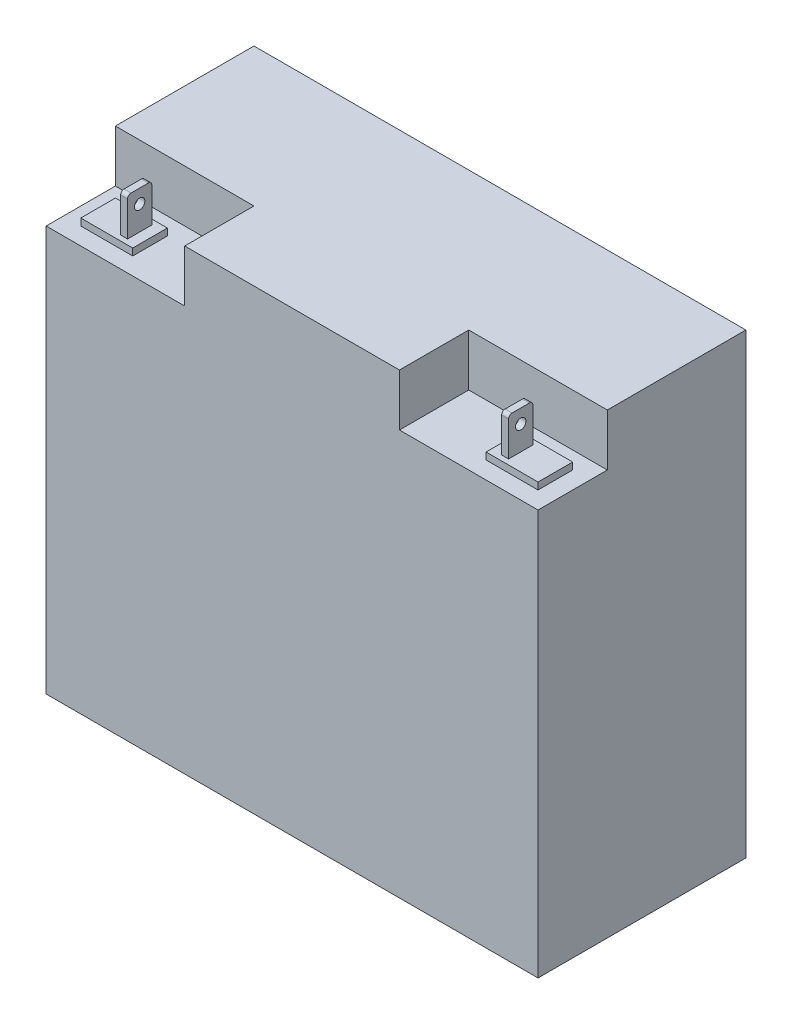
ISO-10303-21;
HEADER;
FILE_DESCRIPTION(('STEP AP214'),'2;1');
FILE_NAME('part.step','',(''),(''),'','','');
FILE_SCHEMA(('AUTOMOTIVE_DESIGN { 1 0 10303 214 1 1 1 1 }'));
ENDSEC;
DATA;
#1=APPLICATION_CONTEXT('core data for automotive mechanical design processes');
#2=APPLICATION_PROTOCOL_DEFINITION('international standard','automotive_design',2000,#1);
#3=PRODUCT_CONTEXT('',#1,'mechanical');
#4=PRODUCT('Part','Part','',(#3));
#5=PRODUCT_RELATED_PRODUCT_CATEGORY('part','',(#4));
#6=PRODUCT_DEFINITION_FORMATION('','',#4);
#7=PRODUCT_DEFINITION_CONTEXT('part definition',#1,'design');
#8=PRODUCT_DEFINITION('design','',#6,#7);
#9=PRODUCT_DEFINITION_SHAPE('','',#8);
#10=(LENGTH_UNIT() NAMED_UNIT(*) SI_UNIT(.MILLI.,.METRE.));
#11=(NAMED_UNIT(*) PLANE_ANGLE_UNIT() SI_UNIT($,.RADIAN.));
#12=(NAMED_UNIT(*) SI_UNIT($,.STERADIAN.) SOLID_ANGLE_UNIT());
#13=UNCERTAINTY_MEASURE_WITH_UNIT(LENGTH_MEASURE(1.E-05),#10,'distance_accuracy_value','');
#14=(GEOMETRIC_REPRESENTATION_CONTEXT(3) GLOBAL_UNCERTAINTY_ASSIGNED_CONTEXT((#13)) GLOBAL_UNIT_ASSIGNED_CONTEXT((#10,
#11,#12)) REPRESENTATION_CONTEXT('',''));
#15=CARTESIAN_POINT('',(0.,0.,0.));
#16=DIRECTION('',(0.,0.,1.));
#17=DIRECTION('',(1.,0.,0.));
#18=AXIS2_PLACEMENT_3D('',#15,#16,#17);
#19=CARTESIAN_POINT('',(161.29,176.885739559386,20.955));
#20=DIRECTION('',(0.,0.,-1.));
#21=DIRECTION('',(-1.,0.,0.));
#22=AXIS2_PLACEMENT_3D('',#19,#20,#21);
#23=PLANE('',#22);
#24=DIRECTION('',(0.,-1.,0.));
#25=VECTOR('',#24,1.);
#26=CARTESIAN_POINT('',(158.75,176.885739559386,20.955));
#27=LINE('',#26,#25);
#28=CARTESIAN_POINT('',(158.75,163.83,20.955));
#29=VERTEX_POINT('',#28);
#30=CARTESIAN_POINT('',(158.75,151.13,20.955));
#31=VERTEX_POINT('',#30);
#32=EDGE_CURVE('E280',#29,#31,#27,.T.);
#33=ORIENTED_EDGE('',*,*,#32,.F.);
#34=DIRECTION('',(-1.,0.,0.));
#35=VECTOR('',#34,1.);
#36=CARTESIAN_POINT('',(180.341,163.83,20.955));
#37=LINE('',#36,#35);
#38=CARTESIAN_POINT('',(161.29,163.83,20.955));
#39=VERTEX_POINT('',#38);
#40=EDGE_CURVE('E242',#39,#29,#37,.T.);
#41=ORIENTED_EDGE('',*,*,#40,.F.);
#42=DIRECTION('',(0.,-1.,0.));
#43=VECTOR('',#42,1.);
#44=CARTESIAN_POINT('',(161.29,176.885739559386,20.955));
#45=LINE('',#44,#43);
#46=CARTESIAN_POINT('',(161.29,151.13,20.955));
#47=VERTEX_POINT('',#46);
#48=EDGE_CURVE('E251',#39,#47,#45,.T.);
#49=ORIENTED_EDGE('',*,*,#48,.T.);
#50=DIRECTION('',(1.,0.,0.));
#51=VECTOR('',#50,1.);
#52=CARTESIAN_POINT('',(161.29,151.13,20.955));
#53=LINE('',#52,#51);
#54=EDGE_CURVE('E266',#31,#47,#53,.T.);
#55=ORIENTED_EDGE('',*,*,#54,.F.);
#56=EDGE_LOOP('',(#33,#41,#49,#55));
#57=FACE_BOUND('',#56,.T.);
#58=ADVANCED_FACE('F39',(#57),#23,.T.);
#59=CARTESIAN_POINT('',(0.,165.1,38.1));
#60=DIRECTION('',(0.,-1.,0.));
#61=DIRECTION('',(0.,0.,-1.));
#62=AXIS2_PLACEMENT_3D('',#59,#60,#61);
#63=PLANE('',#62);
#64=DIRECTION('',(-1.,0.,0.));
#65=VECTOR('',#64,1.);
#66=CARTESIAN_POINT('',(180.341,165.1,22.225));
#67=LINE('',#66,#65);
#68=CARTESIAN_POINT('',(161.29,165.1,22.225));
#69=VERTEX_POINT('',#68);
#70=CARTESIAN_POINT('',(158.75,165.1,22.225));
#71=VERTEX_POINT('',#70);
#72=EDGE_CURVE('E234',#69,#71,#67,.T.);
#73=ORIENTED_EDGE('',*,*,#72,.T.);
#74=DIRECTION('',(0.,0.,1.));
#75=VECTOR('',#74,1.);
#76=CARTESIAN_POINT('',(158.75,165.1,20.955));
#77=LINE('',#76,#75);
#78=CARTESIAN_POINT('',(158.75,165.1,28.575));
#79=VERTEX_POINT('',#78);
#80=EDGE_CURVE('E256',#71,#79,#77,.T.);
#81=ORIENTED_EDGE('',*,*,#80,.T.);
#82=DIRECTION('',(-1.,0.,0.));
#83=VECTOR('',#82,1.);
#84=CARTESIAN_POINT('',(180.341,165.1,28.575));
#85=LINE('',#84,#83);
#86=CARTESIAN_POINT('',(161.29,165.1,28.575));
#87=VERTEX_POINT('',#86);
#88=EDGE_CURVE('E254',#87,#79,#85,.T.);
#89=ORIENTED_EDGE('',*,*,#88,.F.);
#90=DIRECTION('',(0.,0.,-1.));
#91=VECTOR('',#90,1.);
#92=CARTESIAN_POINT('',(161.29,165.1,20.955));
#93=LINE('',#92,#91);
#94=EDGE_CURVE('E249',#87,#69,#93,.T.);
#95=ORIENTED_EDGE('',*,*,#94,.T.);
#96=EDGE_LOOP('',(#73,#81,#89,#95));
#97=FACE_BOUND('',#96,.T.);
#98=ADVANCED_FACE('F253',(#97),#63,.F.);
#99=CARTESIAN_POINT('',(21.59,176.885739559386,20.955));
#100=DIRECTION('',(-1.,0.,0.));
#101=DIRECTION('',(0.,0.,1.));
#102=AXIS2_PLACEMENT_3D('',#99,#100,#101);
#103=PLANE('',#102);
#104=CARTESIAN_POINT('',(21.59,160.02,25.4));
#105=DIRECTION('',(1.,0.,0.));
#106=DIRECTION('',(0.,0.,-1.));
#107=AXIS2_PLACEMENT_3D('',#104,#105,#106);
#108=CIRCLE('',#107,1.90499999999999);
#109=CARTESIAN_POINT('',(21.59,160.02,23.495));
#110=VERTEX_POINT('',#109);
#111=EDGE_CURVE('E332',#110,#110,#108,.T.);
#112=ORIENTED_EDGE('',*,*,#111,.F.);
#113=EDGE_LOOP('',(#112));
#114=FACE_BOUND('',#113,.T.);
#115=CARTESIAN_POINT('',(21.59,163.83,22.225));
#116=DIRECTION('',(1.,0.,0.));
#117=DIRECTION('',(0.,0.,-1.));
#118=AXIS2_PLACEMENT_3D('',#115,#116,#117);
#119=CIRCLE('',#118,1.27);
#120=CARTESIAN_POINT('',(21.59,163.83,20.955));
#121=VERTEX_POINT('',#120);
#122=CARTESIAN_POINT('',(21.59,165.1,22.225));
#123=VERTEX_POINT('',#122);
#124=EDGE_CURVE('E315',#121,#123,#119,.T.);
#125=ORIENTED_EDGE('',*,*,#124,.T.);
#126=DIRECTION('',(0.,0.,1.));
#127=VECTOR('',#126,1.);
#128=CARTESIAN_POINT('',(21.59,165.1,20.955));
#129=LINE('',#128,#127);
#130=CARTESIAN_POINT('',(21.59,165.1,28.575));
#131=VERTEX_POINT('',#130);
#132=EDGE_CURVE('E341',#123,#131,#129,.T.);
#133=ORIENTED_EDGE('',*,*,#132,.T.);
#134=CARTESIAN_POINT('',(21.59,163.83,28.575));
#135=DIRECTION('',(1.,0.,0.));
#136=DIRECTION('',(0.,0.,-1.));
#137=AXIS2_PLACEMENT_3D('',#134,#135,#136);
#138=CIRCLE('',#137,1.27);
#139=CARTESIAN_POINT('',(21.59,163.83,29.845));
#140=VERTEX_POINT('',#139);
#141=EDGE_CURVE('E326',#131,#140,#138,.T.);
#142=ORIENTED_EDGE('',*,*,#141,.T.);
#143=DIRECTION('',(0.,-1.,0.));
#144=VECTOR('',#143,1.);
#145=CARTESIAN_POINT('',(21.59,176.885739559386,29.845));
#146=LINE('',#145,#144);
#147=CARTESIAN_POINT('',(21.59,151.13,29.845));
#148=VERTEX_POINT('',#147);
#149=EDGE_CURVE('E363',#140,#148,#146,.T.);
#150=ORIENTED_EDGE('',*,*,#149,.T.);
#151=DIRECTION('',(0.,0.,-1.));
#152=VECTOR('',#151,1.);
#153=CARTESIAN_POINT('',(21.59,151.13,20.955));
#154=LINE('',#153,#152);
#155=CARTESIAN_POINT('',(21.59,151.13,20.955));
#156=VERTEX_POINT('',#155);
#157=EDGE_CURVE('E353',#148,#156,#154,.T.);
#158=ORIENTED_EDGE('',*,*,#157,.T.);
#159=DIRECTION('',(0.,-1.,0.));
#160=VECTOR('',#159,1.);
#161=CARTESIAN_POINT('',(21.59,176.885739559386,20.955));
#162=LINE('',#161,#160);
#163=EDGE_CURVE('E361',#121,#156,#162,.T.);
#164=ORIENTED_EDGE('',*,*,#163,.F.);
#165=EDGE_LOOP('',(#125,#133,#142,#150,#158,#164));
#166=FACE_BOUND('',#165,.T.);
#167=ADVANCED_FACE('F531',(#114,#166),#103,.F.);
#168=CARTESIAN_POINT('',(19.05,176.885739559386,20.955));
#169=DIRECTION('',(1.,0.,0.));
#170=DIRECTION('',(0.,0.,-1.));
#171=AXIS2_PLACEMENT_3D('',#168,#169,#170);
#172=PLANE('',#171);
#173=CARTESIAN_POINT('',(19.05,160.02,25.4));
#174=DIRECTION('',(1.,0.,0.));
#175=DIRECTION('',(0.,0.,-1.));
#176=AXIS2_PLACEMENT_3D('',#173,#174,#175);
#177=CIRCLE('',#176,1.90499999999999);
#178=CARTESIAN_POINT('',(19.05,160.02,23.495));
#179=VERTEX_POINT('',#178);
#180=EDGE_CURVE('E337',#179,#179,#177,.F.);
#181=ORIENTED_EDGE('',*,*,#180,.F.);
#182=EDGE_LOOP('',(#181));
#183=FACE_BOUND('',#182,.T.);
#184=CARTESIAN_POINT('',(19.05,163.83,22.225));
#185=DIRECTION('',(1.,0.,0.));
#186=DIRECTION('',(0.,0.,-1.));
#187=AXIS2_PLACEMENT_3D('',#184,#185,#186);
#188=CIRCLE('',#187,1.27);
#189=CARTESIAN_POINT('',(19.05,165.1,22.225));
#190=VERTEX_POINT('',#189);
#191=CARTESIAN_POINT('',(19.05,163.83,20.955));
#192=VERTEX_POINT('',#191);
#193=EDGE_CURVE('E312',#190,#192,#188,.F.);
#194=ORIENTED_EDGE('',*,*,#193,.T.);
#195=DIRECTION('',(0.,-1.,0.));
#196=VECTOR('',#195,1.);
#197=CARTESIAN_POINT('',(19.05,176.885739559386,20.955));
#198=LINE('',#197,#196);
#199=CARTESIAN_POINT('',(19.05,151.13,20.955));
#200=VERTEX_POINT('',#199);
#201=EDGE_CURVE('E359',#192,#200,#198,.T.);
#202=ORIENTED_EDGE('',*,*,#201,.T.);
#203=DIRECTION('',(0.,0.,1.));
#204=VECTOR('',#203,1.);
#205=CARTESIAN_POINT('',(19.05,151.13,20.955));
#206=LINE('',#205,#204);
#207=CARTESIAN_POINT('',(19.05,151.13,29.845));
#208=VERTEX_POINT('',#207);
#209=EDGE_CURVE('E340',#200,#208,#206,.T.);
#210=ORIENTED_EDGE('',*,*,#209,.T.);
#211=DIRECTION('',(0.,-1.,0.));
#212=VECTOR('',#211,1.);
#213=CARTESIAN_POINT('',(19.05,176.885739559386,29.845));
#214=LINE('',#213,#212);
#215=CARTESIAN_POINT('',(19.05,163.83,29.845));
#216=VERTEX_POINT('',#215);
#217=EDGE_CURVE('E344',#216,#208,#214,.T.);
#218=ORIENTED_EDGE('',*,*,#217,.F.);
#219=CARTESIAN_POINT('',(19.05,163.83,28.575));
#220=DIRECTION('',(1.,0.,0.));
#221=DIRECTION('',(0.,0.,-1.));
#222=AXIS2_PLACEMENT_3D('',#219,#220,#221);
#223=CIRCLE('',#222,1.27);
#224=CARTESIAN_POINT('',(19.05,165.1,28.575));
#225=VERTEX_POINT('',#224);
#226=EDGE_CURVE('E321',#216,#225,#223,.F.);
#227=ORIENTED_EDGE('',*,*,#226,.T.);
#228=DIRECTION('',(0.,0.,-1.));
#229=VECTOR('',#228,1.);
#230=CARTESIAN_POINT('',(19.05,165.1,20.955));
#231=LINE('',#230,#229);
#232=EDGE_CURVE('E343',#225,#190,#231,.T.);
#233=ORIENTED_EDGE('',*,*,#232,.T.);
#234=EDGE_LOOP('',(#194,#202,#210,#218,#227,#233));
#235=FACE_BOUND('',#234,.T.);
#236=ADVANCED_FACE('F577',(#183,#235),#172,.F.);
#237=CARTESIAN_POINT('',(0.,165.1,38.1));
#238=DIRECTION('',(0.,-1.,0.));
#239=DIRECTION('',(0.,0.,-1.));
#240=AXIS2_PLACEMENT_3D('',#237,#238,#239);
#241=PLANE('',#240);
#242=DIRECTION('',(1.,0.,0.));
#243=VECTOR('',#242,1.);
#244=CARTESIAN_POINT('',(-0.001000000000001,165.1,22.225));
#245=LINE('',#244,#243);
#246=EDGE_CURVE('E319',#190,#123,#245,.T.);
#247=ORIENTED_EDGE('',*,*,#246,.F.);
#248=ORIENTED_EDGE('',*,*,#232,.F.);
#249=DIRECTION('',(1.,0.,0.));
#250=VECTOR('',#249,1.);
#251=CARTESIAN_POINT('',(-0.001000000000001,165.1,28.575));
#252=LINE('',#251,#250);
#253=EDGE_CURVE('E329',#225,#131,#252,.T.);
#254=ORIENTED_EDGE('',*,*,#253,.T.);
#255=ORIENTED_EDGE('',*,*,#132,.F.);
#256=EDGE_LOOP('',(#247,#248,#254,#255));
#257=FACE_BOUND('',#256,.T.);
#258=ADVANCED_FACE('F573',(#257),#241,.F.);
#259=CARTESIAN_POINT('',(19.05,176.885739559386,29.845));
#260=DIRECTION('',(0.,0.,-1.));
#261=DIRECTION('',(-1.,0.,0.));
#262=AXIS2_PLACEMENT_3D('',#259,#260,#261);
#263=PLANE('',#262);
#264=DIRECTION('',(1.,0.,0.));
#265=VECTOR('',#264,1.);
#266=CARTESIAN_POINT('',(-0.001000000000001,163.83,29.845));
#267=LINE('',#266,#265);
#268=EDGE_CURVE('E330',#216,#140,#267,.T.);
#269=ORIENTED_EDGE('',*,*,#268,.F.);
#270=ORIENTED_EDGE('',*,*,#217,.T.);
#271=DIRECTION('',(1.,0.,0.));
#272=VECTOR('',#271,1.);
#273=CARTESIAN_POINT('',(19.05,151.13,29.845));
#274=LINE('',#273,#272);
#275=EDGE_CURVE('E350',#208,#148,#274,.T.);
#276=ORIENTED_EDGE('',*,*,#275,.T.);
#277=ORIENTED_EDGE('',*,*,#149,.F.);
#278=EDGE_LOOP('',(#269,#270,#276,#277));
#279=FACE_BOUND('',#278,.T.);
#280=ADVANCED_FACE('F576',(#279),#263,.F.);
#281=CARTESIAN_POINT('',(0.,151.13,0.));
#282=DIRECTION('',(0.,1.,0.));
#283=DIRECTION('',(0.,0.,1.));
#284=AXIS2_PLACEMENT_3D('',#281,#282,#283);
#285=PLANE('',#284);
#286=DIRECTION('',(1.,0.,0.));
#287=VECTOR('',#286,1.);
#288=CARTESIAN_POINT('',(0.,151.13,31.75));
#289=LINE('',#288,#287);
#290=CARTESIAN_POINT('',(6.35,151.13,31.75));
#291=VERTEX_POINT('',#290);
#292=CARTESIAN_POINT('',(25.4,151.13,31.75));
#293=VERTEX_POINT('',#292);
#294=EDGE_CURVE('E366',#291,#293,#289,.T.);
#295=ORIENTED_EDGE('',*,*,#294,.T.);
#296=DIRECTION('',(0.,0.,-1.));
#297=VECTOR('',#296,1.);
#298=CARTESIAN_POINT('',(25.4,151.13,0.));
#299=LINE('',#298,#297);
#300=CARTESIAN_POINT('',(25.4,151.13,19.05));
#301=VERTEX_POINT('',#300);
#302=EDGE_CURVE('E369',#293,#301,#299,.T.);
#303=ORIENTED_EDGE('',*,*,#302,.T.);
#304=DIRECTION('',(1.,0.,0.));
#305=VECTOR('',#304,1.);
#306=CARTESIAN_POINT('',(0.,151.13,19.05));
#307=LINE('',#306,#305);
#308=CARTESIAN_POINT('',(6.35,151.13,19.05));
#309=VERTEX_POINT('',#308);
#310=EDGE_CURVE('E372',#309,#301,#307,.T.);
#311=ORIENTED_EDGE('',*,*,#310,.F.);
#312=DIRECTION('',(0.,0.,-1.));
#313=VECTOR('',#312,1.);
#314=CARTESIAN_POINT('',(6.35,151.13,0.));
#315=LINE('',#314,#313);
#316=EDGE_CURVE('E375',#291,#309,#315,.T.);
#317=ORIENTED_EDGE('',*,*,#316,.F.);
#318=EDGE_LOOP('',(#295,#303,#311,#317));
#319=FACE_BOUND('',#318,.T.);
#320=ORIENTED_EDGE('',*,*,#209,.F.);
#321=DIRECTION('',(-1.,0.,0.));
#322=VECTOR('',#321,1.);
#323=CARTESIAN_POINT('',(19.05,151.13,20.955));
#324=LINE('',#323,#322);
#325=EDGE_CURVE('E356',#156,#200,#324,.T.);
#326=ORIENTED_EDGE('',*,*,#325,.F.);
#327=ORIENTED_EDGE('',*,*,#157,.F.);
#328=ORIENTED_EDGE('',*,*,#275,.F.);
#329=EDGE_LOOP('',(#320,#326,#327,#328));
#330=FACE_BOUND('',#329,.T.);
#331=ADVANCED_FACE('F588',(#319,#330),#285,.T.);
#332=CARTESIAN_POINT('',(0.,148.59,0.));
#333=DIRECTION('',(0.,1.,0.));
#334=DIRECTION('',(0.,0.,1.));
#335=AXIS2_PLACEMENT_3D('',#332,#333,#334);
#336=PLANE('',#335);
#337=DIRECTION('',(1.,0.,0.));
#338=VECTOR('',#337,1.);
#339=CARTESIAN_POINT('',(0.,148.59,38.1));
#340=LINE('',#339,#338);
#341=CARTESIAN_POINT('',(0.,148.59,38.1));
#342=VERTEX_POINT('',#341);
#343=CARTESIAN_POINT('',(50.8,148.59,38.1));
#344=VERTEX_POINT('',#343);
#345=EDGE_CURVE('E421',#342,#344,#340,.T.);
#346=ORIENTED_EDGE('',*,*,#345,.T.);
#347=DIRECTION('',(0.,0.,-1.));
#348=VECTOR('',#347,1.);
#349=CARTESIAN_POINT('',(50.8,148.59,0.));
#350=LINE('',#349,#348);
#351=CARTESIAN_POINT('',(50.8,148.59,12.7));
#352=VERTEX_POINT('',#351);
#353=EDGE_CURVE('E424',#344,#352,#350,.T.);
#354=ORIENTED_EDGE('',*,*,#353,.T.);
#355=DIRECTION('',(1.,0.,0.));
#356=VECTOR('',#355,1.);
#357=CARTESIAN_POINT('',(0.,148.59,12.7));
#358=LINE('',#357,#356);
#359=CARTESIAN_POINT('',(0.,148.59,12.7));
#360=VERTEX_POINT('',#359);
#361=EDGE_CURVE('E428',#360,#352,#358,.T.);
#362=ORIENTED_EDGE('',*,*,#361,.F.);
#363=DIRECTION('',(0.,0.,1.));
#364=VECTOR('',#363,1.);
#365=CARTESIAN_POINT('',(0.,148.59,0.));
#366=LINE('',#365,#364);
#367=EDGE_CURVE('E430',#360,#342,#366,.T.);
#368=ORIENTED_EDGE('',*,*,#367,.T.);
#369=EDGE_LOOP('',(#346,#354,#362,#368));
#370=FACE_BOUND('',#369,.T.);
#371=DIRECTION('',(0.,0.,-1.));
#372=VECTOR('',#371,1.);
#373=CARTESIAN_POINT('',(25.4,148.59,0.));
#374=LINE('',#373,#372);
#375=CARTESIAN_POINT('',(25.4,148.59,31.75));
#376=VERTEX_POINT('',#375);
#377=CARTESIAN_POINT('',(25.4,148.59,19.05));
#378=VERTEX_POINT('',#377);
#379=EDGE_CURVE('E381',#376,#378,#374,.T.);
#380=ORIENTED_EDGE('',*,*,#379,.F.);
#381=DIRECTION('',(1.,0.,0.));
#382=VECTOR('',#381,1.);
#383=CARTESIAN_POINT('',(0.,148.59,31.75));
#384=LINE('',#383,#382);
#385=CARTESIAN_POINT('',(6.35,148.59,31.75));
#386=VERTEX_POINT('',#385);
#387=EDGE_CURVE('E347',#386,#376,#384,.T.);
#388=ORIENTED_EDGE('',*,*,#387,.F.);
#389=DIRECTION('',(0.,0.,-1.));
#390=VECTOR('',#389,1.);
#391=CARTESIAN_POINT('',(6.35,148.59,0.));
#392=LINE('',#391,#390);
#393=CARTESIAN_POINT('',(6.35,148.59,19.05));
#394=VERTEX_POINT('',#393);
#395=EDGE_CURVE('E370',#386,#394,#392,.T.);
#396=ORIENTED_EDGE('',*,*,#395,.T.);
#397=DIRECTION('',(1.,0.,0.));
#398=VECTOR('',#397,1.);
#399=CARTESIAN_POINT('',(0.,148.59,19.05));
#400=LINE('',#399,#398);
#401=EDGE_CURVE('E384',#394,#378,#400,.T.);
#402=ORIENTED_EDGE('',*,*,#401,.T.);
#403=EDGE_LOOP('',(#380,#388,#396,#402));
#404=FACE_BOUND('',#403,.T.);
#405=ADVANCED_FACE('F508',(#370,#404),#336,.T.);
#406=CARTESIAN_POINT('',(0.,167.64,38.1));
#407=DIRECTION('',(0.,-1.,0.));
#408=DIRECTION('',(0.,0.,-1.));
#409=AXIS2_PLACEMENT_3D('',#406,#407,#408);
#410=PLANE('',#409);
#411=DIRECTION('',(0.,0.,-1.));
#412=VECTOR('',#411,1.);
#413=CARTESIAN_POINT('',(129.54,167.64,0.));
#414=LINE('',#413,#412);
#415=CARTESIAN_POINT('',(129.54,167.64,38.1));
#416=VERTEX_POINT('',#415);
#417=CARTESIAN_POINT('',(129.54,167.64,12.7));
#418=VERTEX_POINT('',#417);
#419=EDGE_CURVE('E398',#416,#418,#414,.T.);
#420=ORIENTED_EDGE('',*,*,#419,.T.);
#421=DIRECTION('',(-1.,0.,0.));
#422=VECTOR('',#421,1.);
#423=CARTESIAN_POINT('',(0.,167.64,12.7));
#424=LINE('',#423,#422);
#425=CARTESIAN_POINT('',(180.34,167.64,12.7));
#426=VERTEX_POINT('',#425);
#427=EDGE_CURVE('E402',#426,#418,#424,.T.);
#428=ORIENTED_EDGE('',*,*,#427,.F.);
#429=DIRECTION('',(0.,0.,-1.));
#430=VECTOR('',#429,1.);
#431=CARTESIAN_POINT('',(180.34,167.64,38.1));
#432=LINE('',#431,#430);
#433=CARTESIAN_POINT('',(180.34,167.64,-38.1));
#434=VERTEX_POINT('',#433);
#435=EDGE_CURVE('E466',#426,#434,#432,.T.);
#436=ORIENTED_EDGE('',*,*,#435,.T.);
#437=DIRECTION('',(-1.,0.,0.));
#438=VECTOR('',#437,1.);
#439=CARTESIAN_POINT('',(0.,167.64,-38.1));
#440=LINE('',#439,#438);
#441=CARTESIAN_POINT('',(0.,167.64,-38.1));
#442=VERTEX_POINT('',#441);
#443=EDGE_CURVE('E448',#434,#442,#440,.T.);
#444=ORIENTED_EDGE('',*,*,#443,.T.);
#445=DIRECTION('',(0.,0.,-1.));
#446=VECTOR('',#445,1.);
#447=CARTESIAN_POINT('',(0.,167.64,38.1));
#448=LINE('',#447,#446);
#449=CARTESIAN_POINT('',(0.,167.64,12.7));
#450=VERTEX_POINT('',#449);
#451=EDGE_CURVE('E455',#450,#442,#448,.T.);
#452=ORIENTED_EDGE('',*,*,#451,.F.);
#453=DIRECTION('',(1.,0.,0.));
#454=VECTOR('',#453,1.);
#455=CARTESIAN_POINT('',(0.,167.64,12.7));
#456=LINE('',#455,#454);
#457=CARTESIAN_POINT('',(50.8,167.64,12.7));
#458=VERTEX_POINT('',#457);
#459=EDGE_CURVE('E425',#450,#458,#456,.T.);
#460=ORIENTED_EDGE('',*,*,#459,.T.);
#461=DIRECTION('',(0.,0.,-1.));
#462=VECTOR('',#461,1.);
#463=CARTESIAN_POINT('',(50.8,167.64,0.));
#464=LINE('',#463,#462);
#465=CARTESIAN_POINT('',(50.8,167.64,38.1));
#466=VERTEX_POINT('',#465);
#467=EDGE_CURVE('E416',#466,#458,#464,.T.);
#468=ORIENTED_EDGE('',*,*,#467,.F.);
#469=DIRECTION('',(-1.,0.,0.));
#470=VECTOR('',#469,1.);
#471=CARTESIAN_POINT('',(0.,167.64,38.1));
#472=LINE('',#471,#470);
#473=EDGE_CURVE('E453',#416,#466,#472,.T.);
#474=ORIENTED_EDGE('',*,*,#473,.F.);
#475=EDGE_LOOP('',(#420,#428,#436,#444,#452,#460,#468,#474));
#476=FACE_BOUND('',#475,.T.);
#477=ADVANCED_FACE('F483',(#476),#410,.F.);
#478=CARTESIAN_POINT('',(0.,0.,38.1));
#479=DIRECTION('',(0.,0.,-1.));
#480=DIRECTION('',(-1.,0.,0.));
#481=AXIS2_PLACEMENT_3D('',#478,#479,#480);
#482=PLANE('',#481);
#483=DIRECTION('',(0.,1.,0.));
#484=VECTOR('',#483,1.);
#485=CARTESIAN_POINT('',(129.54,148.59,38.1));
#486=LINE('',#485,#484);
#487=CARTESIAN_POINT('',(129.54,148.59,38.1));
#488=VERTEX_POINT('',#487);
#489=EDGE_CURVE('E409',#488,#416,#486,.T.);
#490=ORIENTED_EDGE('',*,*,#489,.T.);
#491=ORIENTED_EDGE('',*,*,#473,.T.);
#492=DIRECTION('',(0.,1.,0.));
#493=VECTOR('',#492,1.);
#494=CARTESIAN_POINT('',(50.8,148.59,38.1));
#495=LINE('',#494,#493);
#496=EDGE_CURVE('E432',#344,#466,#495,.T.);
#497=ORIENTED_EDGE('',*,*,#496,.F.);
#498=ORIENTED_EDGE('',*,*,#345,.F.);
#499=DIRECTION('',(0.,-1.,0.));
#500=VECTOR('',#499,1.);
#501=CARTESIAN_POINT('',(0.,0.,38.1));
#502=LINE('',#501,#500);
#503=CARTESIAN_POINT('',(0.,0.,38.1));
#504=VERTEX_POINT('',#503);
#505=EDGE_CURVE('E445',#342,#504,#502,.T.);
#506=ORIENTED_EDGE('',*,*,#505,.T.);
#507=DIRECTION('',(1.,0.,0.));
#508=VECTOR('',#507,1.);
#509=CARTESIAN_POINT('',(0.,0.,38.1));
#510=LINE('',#509,#508);
#511=CARTESIAN_POINT('',(180.34,0.,38.1));
#512=VERTEX_POINT('',#511);
#513=EDGE_CURVE('E447',#504,#512,#510,.T.);
#514=ORIENTED_EDGE('',*,*,#513,.T.);
#515=DIRECTION('',(0.,1.,0.));
#516=VECTOR('',#515,1.);
#517=CARTESIAN_POINT('',(180.34,0.,38.1));
#518=LINE('',#517,#516);
#519=CARTESIAN_POINT('',(180.34,148.59,38.1));
#520=VERTEX_POINT('',#519);
#521=EDGE_CURVE('E450',#512,#520,#518,.T.);
#522=ORIENTED_EDGE('',*,*,#521,.T.);
#523=DIRECTION('',(1.,0.,0.));
#524=VECTOR('',#523,1.);
#525=CARTESIAN_POINT('',(0.,148.59,38.1));
#526=LINE('',#525,#524);
#527=EDGE_CURVE('E401',#488,#520,#526,.T.);
#528=ORIENTED_EDGE('',*,*,#527,.F.);
#529=EDGE_LOOP('',(#490,#491,#497,#498,#506,#514,#522,#528));
#530=FACE_BOUND('',#529,.T.);
#531=ADVANCED_FACE('F495',(#530),#482,.F.);
#532=CARTESIAN_POINT('',(0.,0.,38.1));
#533=DIRECTION('',(1.,0.,0.));
#534=DIRECTION('',(0.,0.,-1.));
#535=AXIS2_PLACEMENT_3D('',#532,#533,#534);
#536=PLANE('',#535);
#537=DIRECTION('',(0.,1.,0.));
#538=VECTOR('',#537,1.);
#539=CARTESIAN_POINT('',(0.,148.59,12.7));
#540=LINE('',#539,#538);
#541=EDGE_CURVE('E437',#360,#450,#540,.T.);
#542=ORIENTED_EDGE('',*,*,#541,.T.);
#543=ORIENTED_EDGE('',*,*,#451,.T.);
#544=DIRECTION('',(0.,-1.,0.));
#545=VECTOR('',#544,1.);
#546=CARTESIAN_POINT('',(0.,0.,-38.1));
#547=LINE('',#546,#545);
#548=CARTESIAN_POINT('',(0.,0.,-38.1));
#549=VERTEX_POINT('',#548);
#550=EDGE_CURVE('E440',#442,#549,#547,.T.);
#551=ORIENTED_EDGE('',*,*,#550,.T.);
#552=DIRECTION('',(0.,0.,-1.));
#553=VECTOR('',#552,1.);
#554=CARTESIAN_POINT('',(0.,0.,38.1));
#555=LINE('',#554,#553);
#556=EDGE_CURVE('E12',#504,#549,#555,.T.);
#557=ORIENTED_EDGE('',*,*,#556,.F.);
#558=ORIENTED_EDGE('',*,*,#505,.F.);
#559=ORIENTED_EDGE('',*,*,#367,.F.);
#560=EDGE_LOOP('',(#542,#543,#551,#557,#558,#559));
#561=FACE_BOUND('',#560,.T.);
#562=ADVANCED_FACE('F41',(#561),#536,.F.);
#563=CARTESIAN_POINT('',(0.,0.,38.1));
#564=DIRECTION('',(0.,1.,0.));
#565=DIRECTION('',(0.,0.,1.));
#566=AXIS2_PLACEMENT_3D('',#563,#564,#565);
#567=PLANE('',#566);
#568=DIRECTION('',(1.,0.,0.));
#569=VECTOR('',#568,1.);
#570=CARTESIAN_POINT('',(0.,0.,-38.1));
#571=LINE('',#570,#569);
#572=CARTESIAN_POINT('',(180.34,0.,-38.1));
#573=VERTEX_POINT('',#572);
#574=EDGE_CURVE('E458',#549,#573,#571,.T.);
#575=ORIENTED_EDGE('',*,*,#574,.T.);
#576=DIRECTION('',(0.,0.,-1.));
#577=VECTOR('',#576,1.);
#578=CARTESIAN_POINT('',(180.34,0.,38.1));
#579=LINE('',#578,#577);
#580=EDGE_CURVE('E47',#512,#573,#579,.T.);
#581=ORIENTED_EDGE('',*,*,#580,.F.);
#582=ORIENTED_EDGE('',*,*,#513,.F.);
#583=ORIENTED_EDGE('',*,*,#556,.T.);
#584=EDGE_LOOP('',(#575,#581,#582,#583));
#585=FACE_BOUND('',#584,.T.);
#586=ADVANCED_FACE('F500',(#585),#567,.F.);
#587=CARTESIAN_POINT('',(180.34,0.,38.1));
#588=DIRECTION('',(-1.,0.,0.));
#589=DIRECTION('',(0.,0.,1.));
#590=AXIS2_PLACEMENT_3D('',#587,#588,#589);
#591=PLANE('',#590);
#592=ORIENTED_EDGE('',*,*,#435,.F.);
#593=DIRECTION('',(0.,1.,0.));
#594=VECTOR('',#593,1.);
#595=CARTESIAN_POINT('',(180.34,148.59,12.7));
#596=LINE('',#595,#594);
#597=CARTESIAN_POINT('',(180.34,148.59,12.7));
#598=VERTEX_POINT('',#597);
#599=EDGE_CURVE('E417',#598,#426,#596,.T.);
#600=ORIENTED_EDGE('',*,*,#599,.F.);
#601=DIRECTION('',(0.,0.,-1.));
#602=VECTOR('',#601,1.);
#603=CARTESIAN_POINT('',(180.34,148.59,0.));
#604=LINE('',#603,#602);
#605=EDGE_CURVE('E404',#520,#598,#604,.T.);
#606=ORIENTED_EDGE('',*,*,#605,.F.);
#607=ORIENTED_EDGE('',*,*,#521,.F.);
#608=ORIENTED_EDGE('',*,*,#580,.T.);
#609=DIRECTION('',(0.,1.,0.));
#610=VECTOR('',#609,1.);
#611=CARTESIAN_POINT('',(180.34,0.,-38.1));
#612=LINE('',#611,#610);
#613=EDGE_CURVE('E460',#573,#434,#612,.T.);
#614=ORIENTED_EDGE('',*,*,#613,.T.);
#615=EDGE_LOOP('',(#592,#600,#606,#607,#608,#614));
#616=FACE_BOUND('',#615,.T.);
#617=ADVANCED_FACE('F473',(#616),#591,.F.);
#618=CARTESIAN_POINT('',(0.,0.,-38.1));
#619=DIRECTION('',(0.,0.,-1.));
#620=DIRECTION('',(-1.,0.,0.));
#621=AXIS2_PLACEMENT_3D('',#618,#619,#620);
#622=PLANE('',#621);
#623=ORIENTED_EDGE('',*,*,#550,.F.);
#624=ORIENTED_EDGE('',*,*,#443,.F.);
#625=ORIENTED_EDGE('',*,*,#613,.F.);
#626=ORIENTED_EDGE('',*,*,#574,.F.);
#627=EDGE_LOOP('',(#623,#624,#625,#626));
#628=FACE_BOUND('',#627,.T.);
#629=ADVANCED_FACE('F480',(#628),#622,.T.);
#630=CARTESIAN_POINT('',(0.,148.59,12.7));
#631=DIRECTION('',(0.,0.,1.));
#632=DIRECTION('',(1.,0.,0.));
#633=AXIS2_PLACEMENT_3D('',#630,#631,#632);
#634=PLANE('',#633);
#635=ORIENTED_EDGE('',*,*,#459,.F.);
#636=ORIENTED_EDGE('',*,*,#541,.F.);
#637=ORIENTED_EDGE('',*,*,#361,.T.);
#638=DIRECTION('',(0.,1.,0.));
#639=VECTOR('',#638,1.);
#640=CARTESIAN_POINT('',(50.8,148.59,12.7));
#641=LINE('',#640,#639);
#642=EDGE_CURVE('E441',#352,#458,#641,.T.);
#643=ORIENTED_EDGE('',*,*,#642,.T.);
#644=EDGE_LOOP('',(#635,#636,#637,#643));
#645=FACE_BOUND('',#644,.T.);
#646=ADVANCED_FACE('F505',(#645),#634,.T.);
#647=CARTESIAN_POINT('',(50.8,148.59,0.));
#648=DIRECTION('',(1.,0.,0.));
#649=DIRECTION('',(0.,0.,-1.));
#650=AXIS2_PLACEMENT_3D('',#647,#648,#649);
#651=PLANE('',#650);
#652=ORIENTED_EDGE('',*,*,#467,.T.);
#653=ORIENTED_EDGE('',*,*,#642,.F.);
#654=ORIENTED_EDGE('',*,*,#353,.F.);
#655=ORIENTED_EDGE('',*,*,#496,.T.);
#656=EDGE_LOOP('',(#652,#653,#654,#655));
#657=FACE_BOUND('',#656,.T.);
#658=ADVANCED_FACE('F512',(#657),#651,.F.);
#659=CARTESIAN_POINT('',(129.54,148.59,0.));
#660=DIRECTION('',(1.,0.,0.));
#661=DIRECTION('',(0.,0.,-1.));
#662=AXIS2_PLACEMENT_3D('',#659,#660,#661);
#663=PLANE('',#662);
#664=ORIENTED_EDGE('',*,*,#419,.F.);
#665=ORIENTED_EDGE('',*,*,#489,.F.);
#666=DIRECTION('',(0.,0.,-1.));
#667=VECTOR('',#666,1.);
#668=CARTESIAN_POINT('',(129.54,148.59,0.));
#669=LINE('',#668,#667);
#670=CARTESIAN_POINT('',(129.54,148.59,12.7));
#671=VERTEX_POINT('',#670);
#672=EDGE_CURVE('E399',#488,#671,#669,.T.);
#673=ORIENTED_EDGE('',*,*,#672,.T.);
#674=DIRECTION('',(0.,1.,0.));
#675=VECTOR('',#674,1.);
#676=CARTESIAN_POINT('',(129.54,148.59,12.7));
#677=LINE('',#676,#675);
#678=EDGE_CURVE('E414',#671,#418,#677,.T.);
#679=ORIENTED_EDGE('',*,*,#678,.T.);
#680=EDGE_LOOP('',(#664,#665,#673,#679));
#681=FACE_BOUND('',#680,.T.);
#682=ADVANCED_FACE('F515',(#681),#663,.T.);
#683=CARTESIAN_POINT('',(0.,148.59,12.7));
#684=DIRECTION('',(0.,0.,-1.));
#685=DIRECTION('',(-1.,0.,0.));
#686=AXIS2_PLACEMENT_3D('',#683,#684,#685);
#687=PLANE('',#686);
#688=ORIENTED_EDGE('',*,*,#427,.T.);
#689=ORIENTED_EDGE('',*,*,#678,.F.);
#690=DIRECTION('',(-1.,0.,0.));
#691=VECTOR('',#690,1.);
#692=CARTESIAN_POINT('',(0.,148.59,12.7));
#693=LINE('',#692,#691);
#694=EDGE_CURVE('E406',#598,#671,#693,.T.);
#695=ORIENTED_EDGE('',*,*,#694,.F.);
#696=ORIENTED_EDGE('',*,*,#599,.T.);
#697=EDGE_LOOP('',(#688,#689,#695,#696));
#698=FACE_BOUND('',#697,.T.);
#699=ADVANCED_FACE('F488',(#698),#687,.F.);
#700=CARTESIAN_POINT('',(0.,148.59,0.));
#701=DIRECTION('',(0.,1.,0.));
#702=DIRECTION('',(0.,0.,1.));
#703=AXIS2_PLACEMENT_3D('',#700,#701,#702);
#704=PLANE('',#703);
#705=DIRECTION('',(0.,0.,-1.));
#706=VECTOR('',#705,1.);
#707=CARTESIAN_POINT('',(154.94,148.59,0.));
#708=LINE('',#707,#706);
#709=CARTESIAN_POINT('',(154.94,148.59,31.75));
#710=VERTEX_POINT('',#709);
#711=CARTESIAN_POINT('',(154.94,148.59,19.05));
#712=VERTEX_POINT('',#711);
#713=EDGE_CURVE('E258',#710,#712,#708,.T.);
#714=ORIENTED_EDGE('',*,*,#713,.T.);
#715=DIRECTION('',(1.,0.,0.));
#716=VECTOR('',#715,1.);
#717=CARTESIAN_POINT('',(0.,148.59,19.0500000000001));
#718=LINE('',#717,#716);
#719=CARTESIAN_POINT('',(173.99,148.59,19.05));
#720=VERTEX_POINT('',#719);
#721=EDGE_CURVE('E284',#712,#720,#718,.T.);
#722=ORIENTED_EDGE('',*,*,#721,.T.);
#723=DIRECTION('',(0.,0.,1.));
#724=VECTOR('',#723,1.);
#725=CARTESIAN_POINT('',(173.99,148.59,0.));
#726=LINE('',#725,#724);
#727=CARTESIAN_POINT('',(173.99,148.59,31.75));
#728=VERTEX_POINT('',#727);
#729=EDGE_CURVE('E286',#720,#728,#726,.T.);
#730=ORIENTED_EDGE('',*,*,#729,.T.);
#731=DIRECTION('',(-1.,0.,0.));
#732=VECTOR('',#731,1.);
#733=CARTESIAN_POINT('',(0.,148.59,31.75));
#734=LINE('',#733,#732);
#735=EDGE_CURVE('E255',#728,#710,#734,.T.);
#736=ORIENTED_EDGE('',*,*,#735,.T.);
#737=EDGE_LOOP('',(#714,#722,#730,#736));
#738=FACE_BOUND('',#737,.T.);
#739=ORIENTED_EDGE('',*,*,#672,.F.);
#740=ORIENTED_EDGE('',*,*,#527,.T.);
#741=ORIENTED_EDGE('',*,*,#605,.T.);
#742=ORIENTED_EDGE('',*,*,#694,.T.);
#743=EDGE_LOOP('',(#739,#740,#741,#742));
#744=FACE_BOUND('',#743,.T.);
#745=ADVANCED_FACE('F491',(#738,#744),#704,.T.);
#746=CARTESIAN_POINT('',(0.,151.13,31.75));
#747=DIRECTION('',(0.,0.,-1.));
#748=DIRECTION('',(-1.,0.,0.));
#749=AXIS2_PLACEMENT_3D('',#746,#747,#748);
#750=PLANE('',#749);
#751=ORIENTED_EDGE('',*,*,#387,.T.);
#752=DIRECTION('',(0.,-1.,0.));
#753=VECTOR('',#752,1.);
#754=CARTESIAN_POINT('',(25.4,151.13,31.75));
#755=LINE('',#754,#753);
#756=EDGE_CURVE('E395',#293,#376,#755,.T.);
#757=ORIENTED_EDGE('',*,*,#756,.F.);
#758=ORIENTED_EDGE('',*,*,#294,.F.);
#759=DIRECTION('',(0.,-1.,0.));
#760=VECTOR('',#759,1.);
#761=CARTESIAN_POINT('',(6.35,151.13,31.75));
#762=LINE('',#761,#760);
#763=EDGE_CURVE('E378',#291,#386,#762,.T.);
#764=ORIENTED_EDGE('',*,*,#763,.T.);
#765=EDGE_LOOP('',(#751,#757,#758,#764));
#766=FACE_BOUND('',#765,.T.);
#767=ADVANCED_FACE('F606',(#766),#750,.F.);
#768=CARTESIAN_POINT('',(25.4,151.13,0.));
#769=DIRECTION('',(-1.,0.,0.));
#770=DIRECTION('',(0.,0.,1.));
#771=AXIS2_PLACEMENT_3D('',#768,#769,#770);
#772=PLANE('',#771);
#773=ORIENTED_EDGE('',*,*,#379,.T.);
#774=DIRECTION('',(0.,-1.,0.));
#775=VECTOR('',#774,1.);
#776=CARTESIAN_POINT('',(25.4,151.13,19.05));
#777=LINE('',#776,#775);
#778=EDGE_CURVE('E392',#301,#378,#777,.T.);
#779=ORIENTED_EDGE('',*,*,#778,.F.);
#780=ORIENTED_EDGE('',*,*,#302,.F.);
#781=ORIENTED_EDGE('',*,*,#756,.T.);
#782=EDGE_LOOP('',(#773,#779,#780,#781));
#783=FACE_BOUND('',#782,.T.);
#784=ADVANCED_FACE('F602',(#783),#772,.F.);
#785=CARTESIAN_POINT('',(0.,151.13,19.05));
#786=DIRECTION('',(0.,0.,-1.));
#787=DIRECTION('',(-1.,0.,0.));
#788=AXIS2_PLACEMENT_3D('',#785,#786,#787);
#789=PLANE('',#788);
#790=ORIENTED_EDGE('',*,*,#401,.F.);
#791=DIRECTION('',(0.,-1.,0.));
#792=VECTOR('',#791,1.);
#793=CARTESIAN_POINT('',(6.35,151.13,19.05));
#794=LINE('',#793,#792);
#795=EDGE_CURVE('E389',#309,#394,#794,.T.);
#796=ORIENTED_EDGE('',*,*,#795,.F.);
#797=ORIENTED_EDGE('',*,*,#310,.T.);
#798=ORIENTED_EDGE('',*,*,#778,.T.);
#799=EDGE_LOOP('',(#790,#796,#797,#798));
#800=FACE_BOUND('',#799,.T.);
#801=ADVANCED_FACE('F598',(#800),#789,.T.);
#802=CARTESIAN_POINT('',(6.35,151.13,0.));
#803=DIRECTION('',(-1.,0.,0.));
#804=DIRECTION('',(0.,0.,1.));
#805=AXIS2_PLACEMENT_3D('',#802,#803,#804);
#806=PLANE('',#805);
#807=ORIENTED_EDGE('',*,*,#395,.F.);
#808=ORIENTED_EDGE('',*,*,#763,.F.);
#809=ORIENTED_EDGE('',*,*,#316,.T.);
#810=ORIENTED_EDGE('',*,*,#795,.T.);
#811=EDGE_LOOP('',(#807,#808,#809,#810));
#812=FACE_BOUND('',#811,.T.);
#813=ADVANCED_FACE('F581',(#812),#806,.T.);
#814=CARTESIAN_POINT('',(19.05,176.885739559386,20.955));
#815=DIRECTION('',(0.,0.,1.));
#816=DIRECTION('',(1.,0.,0.));
#817=AXIS2_PLACEMENT_3D('',#814,#815,#816);
#818=PLANE('',#817);
#819=ORIENTED_EDGE('',*,*,#201,.F.);
#820=DIRECTION('',(1.,0.,0.));
#821=VECTOR('',#820,1.);
#822=CARTESIAN_POINT('',(-0.001000000000001,163.83,20.955));
#823=LINE('',#822,#821);
#824=EDGE_CURVE('E318',#192,#121,#823,.T.);
#825=ORIENTED_EDGE('',*,*,#824,.T.);
#826=ORIENTED_EDGE('',*,*,#163,.T.);
#827=ORIENTED_EDGE('',*,*,#325,.T.);
#828=EDGE_LOOP('',(#819,#825,#826,#827));
#829=FACE_BOUND('',#828,.T.);
#830=ADVANCED_FACE('F571',(#829),#818,.F.);
#831=CARTESIAN_POINT('',(-0.001000000000001,160.02,25.4));
#832=DIRECTION('',(1.,0.,0.));
#833=DIRECTION('',(0.,0.,-1.));
#834=AXIS2_PLACEMENT_3D('',#831,#832,#833);
#835=CYLINDRICAL_SURFACE('',#834,1.90499999999999);
#836=ORIENTED_EDGE('',*,*,#111,.T.);
#837=EDGE_LOOP('',(#836));
#838=FACE_BOUND('',#837,.T.);
#839=ORIENTED_EDGE('',*,*,#180,.T.);
#840=EDGE_LOOP('',(#839));
#841=FACE_BOUND('',#840,.T.);
#842=ADVANCED_FACE('F567',(#838,#841),#835,.F.);
#843=CARTESIAN_POINT('',(-0.001000000000001,163.83,28.575));
#844=DIRECTION('',(1.,0.,0.));
#845=DIRECTION('',(0.,0.,-1.));
#846=AXIS2_PLACEMENT_3D('',#843,#844,#845);
#847=CYLINDRICAL_SURFACE('',#846,1.27);
#848=ORIENTED_EDGE('',*,*,#268,.T.);
#849=ORIENTED_EDGE('',*,*,#141,.F.);
#850=ORIENTED_EDGE('',*,*,#253,.F.);
#851=ORIENTED_EDGE('',*,*,#226,.F.);
#852=EDGE_LOOP('',(#848,#849,#850,#851));
#853=FACE_BOUND('',#852,.T.);
#854=ADVANCED_FACE('F563',(#853),#847,.T.);
#855=CARTESIAN_POINT('',(-0.001000000000001,163.83,22.225));
#856=DIRECTION('',(1.,0.,0.));
#857=DIRECTION('',(0.,0.,-1.));
#858=AXIS2_PLACEMENT_3D('',#855,#856,#857);
#859=CYLINDRICAL_SURFACE('',#858,1.27);
#860=ORIENTED_EDGE('',*,*,#246,.T.);
#861=ORIENTED_EDGE('',*,*,#124,.F.);
#862=ORIENTED_EDGE('',*,*,#824,.F.);
#863=ORIENTED_EDGE('',*,*,#193,.F.);
#864=EDGE_LOOP('',(#860,#861,#862,#863));
#865=FACE_BOUND('',#864,.T.);
#866=ADVANCED_FACE('F559',(#865),#859,.T.);
#867=CARTESIAN_POINT('',(0.,151.13,0.));
#868=DIRECTION('',(0.,1.,0.));
#869=DIRECTION('',(0.,0.,1.));
#870=AXIS2_PLACEMENT_3D('',#867,#868,#869);
#871=PLANE('',#870);
#872=DIRECTION('',(0.,0.,1.));
#873=VECTOR('',#872,1.);
#874=CARTESIAN_POINT('',(161.29,151.13,20.955));
#875=LINE('',#874,#873);
#876=CARTESIAN_POINT('',(161.29,151.13,29.845));
#877=VERTEX_POINT('',#876);
#878=EDGE_CURVE('E263',#47,#877,#875,.T.);
#879=ORIENTED_EDGE('',*,*,#878,.T.);
#880=DIRECTION('',(-1.,0.,0.));
#881=VECTOR('',#880,1.);
#882=CARTESIAN_POINT('',(161.29,151.13,29.845));
#883=LINE('',#882,#881);
#884=CARTESIAN_POINT('',(158.75,151.13,29.845));
#885=VERTEX_POINT('',#884);
#886=EDGE_CURVE('E273',#877,#885,#883,.T.);
#887=ORIENTED_EDGE('',*,*,#886,.T.);
#888=DIRECTION('',(0.,0.,-1.));
#889=VECTOR('',#888,1.);
#890=CARTESIAN_POINT('',(158.75,151.13,20.955));
#891=LINE('',#890,#889);
#892=EDGE_CURVE('E270',#885,#31,#891,.T.);
#893=ORIENTED_EDGE('',*,*,#892,.T.);
#894=ORIENTED_EDGE('',*,*,#54,.T.);
#895=EDGE_LOOP('',(#879,#887,#893,#894));
#896=FACE_BOUND('',#895,.T.);
#897=DIRECTION('',(-1.,0.,0.));
#898=VECTOR('',#897,1.);
#899=CARTESIAN_POINT('',(0.,151.13,31.75));
#900=LINE('',#899,#898);
#901=CARTESIAN_POINT('',(173.99,151.13,31.75));
#902=VERTEX_POINT('',#901);
#903=CARTESIAN_POINT('',(154.94,151.13,31.75));
#904=VERTEX_POINT('',#903);
#905=EDGE_CURVE('E292',#902,#904,#900,.T.);
#906=ORIENTED_EDGE('',*,*,#905,.F.);
#907=DIRECTION('',(0.,0.,1.));
#908=VECTOR('',#907,1.);
#909=CARTESIAN_POINT('',(173.99,151.13,0.));
#910=LINE('',#909,#908);
#911=CARTESIAN_POINT('',(173.99,151.13,19.05));
#912=VERTEX_POINT('',#911);
#913=EDGE_CURVE('E297',#912,#902,#910,.T.);
#914=ORIENTED_EDGE('',*,*,#913,.F.);
#915=DIRECTION('',(1.,0.,0.));
#916=VECTOR('',#915,1.);
#917=CARTESIAN_POINT('',(0.,151.13,19.0500000000001));
#918=LINE('',#917,#916);
#919=CARTESIAN_POINT('',(154.94,151.13,19.05));
#920=VERTEX_POINT('',#919);
#921=EDGE_CURVE('E301',#920,#912,#918,.T.);
#922=ORIENTED_EDGE('',*,*,#921,.F.);
#923=DIRECTION('',(0.,0.,-1.));
#924=VECTOR('',#923,1.);
#925=CARTESIAN_POINT('',(154.94,151.13,0.));
#926=LINE('',#925,#924);
#927=EDGE_CURVE('E287',#904,#920,#926,.T.);
#928=ORIENTED_EDGE('',*,*,#927,.F.);
#929=EDGE_LOOP('',(#906,#914,#922,#928));
#930=FACE_BOUND('',#929,.T.);
#931=ADVANCED_FACE('F555',(#896,#930),#871,.T.);
#932=CARTESIAN_POINT('',(154.94,174.025250599196,0.));
#933=DIRECTION('',(-1.,0.,0.));
#934=DIRECTION('',(0.,0.,1.));
#935=AXIS2_PLACEMENT_3D('',#932,#933,#934);
#936=PLANE('',#935);
#937=DIRECTION('',(0.,-1.,0.));
#938=VECTOR('',#937,1.);
#939=CARTESIAN_POINT('',(154.94,174.025250599196,31.75));
#940=LINE('',#939,#938);
#941=EDGE_CURVE('E295',#904,#710,#940,.T.);
#942=ORIENTED_EDGE('',*,*,#941,.F.);
#943=ORIENTED_EDGE('',*,*,#927,.T.);
#944=DIRECTION('',(0.,-1.,0.));
#945=VECTOR('',#944,1.);
#946=CARTESIAN_POINT('',(154.94,174.025250599196,19.05));
#947=LINE('',#946,#945);
#948=EDGE_CURVE('E291',#920,#712,#947,.T.);
#949=ORIENTED_EDGE('',*,*,#948,.T.);
#950=ORIENTED_EDGE('',*,*,#713,.F.);
#951=EDGE_LOOP('',(#942,#943,#949,#950));
#952=FACE_BOUND('',#951,.T.);
#953=ADVANCED_FACE('F551',(#952),#936,.T.);
#954=CARTESIAN_POINT('',(0.,174.025250599196,19.0500000000001));
#955=DIRECTION('',(0.,0.,-1.));
#956=DIRECTION('',(-1.,0.,0.));
#957=AXIS2_PLACEMENT_3D('',#954,#955,#956);
#958=PLANE('',#957);
#959=ORIENTED_EDGE('',*,*,#948,.F.);
#960=ORIENTED_EDGE('',*,*,#921,.T.);
#961=DIRECTION('',(0.,-1.,0.));
#962=VECTOR('',#961,1.);
#963=CARTESIAN_POINT('',(173.99,174.025250599196,19.05));
#964=LINE('',#963,#962);
#965=EDGE_CURVE('E300',#912,#720,#964,.T.);
#966=ORIENTED_EDGE('',*,*,#965,.T.);
#967=ORIENTED_EDGE('',*,*,#721,.F.);
#968=EDGE_LOOP('',(#959,#960,#966,#967));
#969=FACE_BOUND('',#968,.T.);
#970=ADVANCED_FACE('F547',(#969),#958,.T.);
#971=CARTESIAN_POINT('',(173.99,174.025250599196,0.));
#972=DIRECTION('',(1.,0.,0.));
#973=DIRECTION('',(0.,0.,-1.));
#974=AXIS2_PLACEMENT_3D('',#971,#972,#973);
#975=PLANE('',#974);
#976=ORIENTED_EDGE('',*,*,#965,.F.);
#977=ORIENTED_EDGE('',*,*,#913,.T.);
#978=DIRECTION('',(0.,-1.,0.));
#979=VECTOR('',#978,1.);
#980=CARTESIAN_POINT('',(173.99,174.025250599196,31.75));
#981=LINE('',#980,#979);
#982=EDGE_CURVE('E296',#902,#728,#981,.T.);
#983=ORIENTED_EDGE('',*,*,#982,.T.);
#984=ORIENTED_EDGE('',*,*,#729,.F.);
#985=EDGE_LOOP('',(#976,#977,#983,#984));
#986=FACE_BOUND('',#985,.T.);
#987=ADVANCED_FACE('F543',(#986),#975,.T.);
#988=CARTESIAN_POINT('',(0.,174.025250599196,31.75));
#989=DIRECTION('',(0.,0.,1.));
#990=DIRECTION('',(1.,0.,0.));
#991=AXIS2_PLACEMENT_3D('',#988,#989,#990);
#992=PLANE('',#991);
#993=ORIENTED_EDGE('',*,*,#982,.F.);
#994=ORIENTED_EDGE('',*,*,#905,.T.);
#995=ORIENTED_EDGE('',*,*,#941,.T.);
#996=ORIENTED_EDGE('',*,*,#735,.F.);
#997=EDGE_LOOP('',(#993,#994,#995,#996));
#998=FACE_BOUND('',#997,.T.);
#999=ADVANCED_FACE('F540',(#998),#992,.T.);
#1000=CARTESIAN_POINT('',(161.29,176.885739559386,20.955));
#1001=DIRECTION('',(1.,0.,0.));
#1002=DIRECTION('',(0.,0.,-1.));
#1003=AXIS2_PLACEMENT_3D('',#1000,#1001,#1002);
#1004=PLANE('',#1003);
#1005=CARTESIAN_POINT('',(161.29,163.83,22.225));
#1006=DIRECTION('',(1.,0.,0.));
#1007=DIRECTION('',(0.,0.,-1.));
#1008=AXIS2_PLACEMENT_3D('',#1005,#1006,#1007);
#1009=CIRCLE('',#1008,1.27);
#1010=EDGE_CURVE('E237',#39,#69,#1009,.T.);
#1011=ORIENTED_EDGE('',*,*,#1010,.T.);
#1012=ORIENTED_EDGE('',*,*,#94,.F.);
#1013=CARTESIAN_POINT('',(161.29,163.83,28.575));
#1014=DIRECTION('',(1.,0.,0.));
#1015=DIRECTION('',(0.,0.,-1.));
#1016=AXIS2_PLACEMENT_3D('',#1013,#1014,#1015);
#1017=CIRCLE('',#1016,1.27);
#1018=CARTESIAN_POINT('',(161.29,163.83,29.845));
#1019=VERTEX_POINT('',#1018);
#1020=EDGE_CURVE('E62',#87,#1019,#1017,.T.);
#1021=ORIENTED_EDGE('',*,*,#1020,.T.);
#1022=DIRECTION('',(0.,-1.,0.));
#1023=VECTOR('',#1022,1.);
#1024=CARTESIAN_POINT('',(161.29,176.885739559386,29.845));
#1025=LINE('',#1024,#1023);
#1026=EDGE_CURVE('E276',#1019,#877,#1025,.T.);
#1027=ORIENTED_EDGE('',*,*,#1026,.T.);
#1028=ORIENTED_EDGE('',*,*,#878,.F.);
#1029=ORIENTED_EDGE('',*,*,#48,.F.);
#1030=EDGE_LOOP('',(#1011,#1012,#1021,#1027,#1028,#1029));
#1031=FACE_BOUND('',#1030,.T.);
#1032=CARTESIAN_POINT('',(161.29,160.02,25.4));
#1033=DIRECTION('',(1.,0.,0.));
#1034=DIRECTION('',(0.,0.,-1.));
#1035=AXIS2_PLACEMENT_3D('',#1032,#1033,#1034);
#1036=CIRCLE('',#1035,1.90499999999999);
#1037=CARTESIAN_POINT('',(161.29,160.02,23.495));
#1038=VERTEX_POINT('',#1037);
#1039=EDGE_CURVE('E267',#1038,#1038,#1036,.T.);
#1040=ORIENTED_EDGE('',*,*,#1039,.F.);
#1041=EDGE_LOOP('',(#1040));
#1042=FACE_BOUND('',#1041,.T.);
#1043=ADVANCED_FACE('F247',(#1031,#1042),#1004,.T.);
#1044=CARTESIAN_POINT('',(158.75,176.885739559386,20.955));
#1045=DIRECTION('',(-1.,0.,0.));
#1046=DIRECTION('',(0.,0.,1.));
#1047=AXIS2_PLACEMENT_3D('',#1044,#1045,#1046);
#1048=PLANE('',#1047);
#1049=CARTESIAN_POINT('',(158.75,163.83,22.225));
#1050=DIRECTION('',(1.,0.,0.));
#1051=DIRECTION('',(0.,0.,-1.));
#1052=AXIS2_PLACEMENT_3D('',#1049,#1050,#1051);
#1053=CIRCLE('',#1052,1.27);
#1054=EDGE_CURVE('E54',#29,#71,#1053,.T.);
#1055=ORIENTED_EDGE('',*,*,#1054,.F.);
#1056=ORIENTED_EDGE('',*,*,#32,.T.);
#1057=ORIENTED_EDGE('',*,*,#892,.F.);
#1058=DIRECTION('',(0.,-1.,0.));
#1059=VECTOR('',#1058,1.);
#1060=CARTESIAN_POINT('',(158.75,176.885739559386,29.845));
#1061=LINE('',#1060,#1059);
#1062=CARTESIAN_POINT('',(158.75,163.83,29.845));
#1063=VERTEX_POINT('',#1062);
#1064=EDGE_CURVE('E278',#1063,#885,#1061,.T.);
#1065=ORIENTED_EDGE('',*,*,#1064,.F.);
#1066=CARTESIAN_POINT('',(158.75,163.83,28.575));
#1067=DIRECTION('',(1.,0.,0.));
#1068=DIRECTION('',(0.,0.,-1.));
#1069=AXIS2_PLACEMENT_3D('',#1066,#1067,#1068);
#1070=CIRCLE('',#1069,1.27);
#1071=EDGE_CURVE('E884',#79,#1063,#1070,.T.);
#1072=ORIENTED_EDGE('',*,*,#1071,.F.);
#1073=ORIENTED_EDGE('',*,*,#80,.F.);
#1074=EDGE_LOOP('',(#1055,#1056,#1057,#1065,#1072,#1073));
#1075=FACE_BOUND('',#1074,.T.);
#1076=CARTESIAN_POINT('',(158.75,160.02,25.4));
#1077=DIRECTION('',(1.,0.,0.));
#1078=DIRECTION('',(0.,0.,-1.));
#1079=AXIS2_PLACEMENT_3D('',#1076,#1077,#1078);
#1080=CIRCLE('',#1079,1.90499999999999);
#1081=CARTESIAN_POINT('',(158.75,160.02,23.495));
#1082=VERTEX_POINT('',#1081);
#1083=EDGE_CURVE('E886',#1082,#1082,#1080,.T.);
#1084=ORIENTED_EDGE('',*,*,#1083,.T.);
#1085=EDGE_LOOP('',(#1084));
#1086=FACE_BOUND('',#1085,.T.);
#1087=ADVANCED_FACE('F536',(#1075,#1086),#1048,.T.);
#1088=CARTESIAN_POINT('',(161.29,176.885739559386,29.845));
#1089=DIRECTION('',(0.,0.,1.));
#1090=DIRECTION('',(1.,0.,0.));
#1091=AXIS2_PLACEMENT_3D('',#1088,#1089,#1090);
#1092=PLANE('',#1091);
#1093=DIRECTION('',(-1.,0.,0.));
#1094=VECTOR('',#1093,1.);
#1095=CARTESIAN_POINT('',(180.341,163.83,29.845));
#1096=LINE('',#1095,#1094);
#1097=EDGE_CURVE('E887',#1019,#1063,#1096,.T.);
#1098=ORIENTED_EDGE('',*,*,#1097,.T.);
#1099=ORIENTED_EDGE('',*,*,#1064,.T.);
#1100=ORIENTED_EDGE('',*,*,#886,.F.);
#1101=ORIENTED_EDGE('',*,*,#1026,.F.);
#1102=EDGE_LOOP('',(#1098,#1099,#1100,#1101));
#1103=FACE_BOUND('',#1102,.T.);
#1104=ADVANCED_FACE('F691',(#1103),#1092,.T.);
#1105=CARTESIAN_POINT('',(180.341,160.02,25.4));
#1106=DIRECTION('',(-1.,0.,0.));
#1107=DIRECTION('',(0.,0.,1.));
#1108=AXIS2_PLACEMENT_3D('',#1105,#1106,#1107);
#1109=CYLINDRICAL_SURFACE('',#1108,1.90499999999999);
#1110=ORIENTED_EDGE('',*,*,#1039,.T.);
#1111=EDGE_LOOP('',(#1110));
#1112=FACE_BOUND('',#1111,.T.);
#1113=ORIENTED_EDGE('',*,*,#1083,.F.);
#1114=EDGE_LOOP('',(#1113));
#1115=FACE_BOUND('',#1114,.T.);
#1116=ADVANCED_FACE('F698',(#1112,#1115),#1109,.F.);
#1117=CARTESIAN_POINT('',(180.341,163.83,28.575));
#1118=DIRECTION('',(-1.,0.,0.));
#1119=DIRECTION('',(0.,0.,1.));
#1120=AXIS2_PLACEMENT_3D('',#1117,#1118,#1119);
#1121=CYLINDRICAL_SURFACE('',#1120,1.27);
#1122=ORIENTED_EDGE('',*,*,#88,.T.);
#1123=ORIENTED_EDGE('',*,*,#1071,.T.);
#1124=ORIENTED_EDGE('',*,*,#1097,.F.);
#1125=ORIENTED_EDGE('',*,*,#1020,.F.);
#1126=EDGE_LOOP('',(#1122,#1123,#1124,#1125));
#1127=FACE_BOUND('',#1126,.T.);
#1128=ADVANCED_FACE('F705',(#1127),#1121,.T.);
#1129=CARTESIAN_POINT('',(180.341,163.83,22.225));
#1130=DIRECTION('',(-1.,0.,0.));
#1131=DIRECTION('',(0.,0.,1.));
#1132=AXIS2_PLACEMENT_3D('',#1129,#1130,#1131);
#1133=CYLINDRICAL_SURFACE('',#1132,1.27);
#1134=ORIENTED_EDGE('',*,*,#40,.T.);
#1135=ORIENTED_EDGE('',*,*,#1054,.T.);
#1136=ORIENTED_EDGE('',*,*,#72,.F.);
#1137=ORIENTED_EDGE('',*,*,#1010,.F.);
#1138=EDGE_LOOP('',(#1134,#1135,#1136,#1137));
#1139=FACE_BOUND('',#1138,.T.);
#1140=ADVANCED_FACE('F236',(#1139),#1133,.T.);
#1141=CLOSED_SHELL('',(#58,#98,#167,#236,#258,#280,#331,#405,#477,#531,#562,#586,#617,#629,#646,
#658,#682,#699,#745,#767,#784,#801,#813,#830,#842,#854,#866,#931,#953,#970,#987,#999,#1043,
#1087,#1104,#1116,#1128,#1140));
#1142=MANIFOLD_SOLID_BREP('B2',#1141);
#1143=ADVANCED_BREP_SHAPE_REPRESENTATION('',(#18,#1142),#14);
#1144=SHAPE_DEFINITION_REPRESENTATION(#9,#1143);
ENDSEC;
END-ISO-10303-21;
